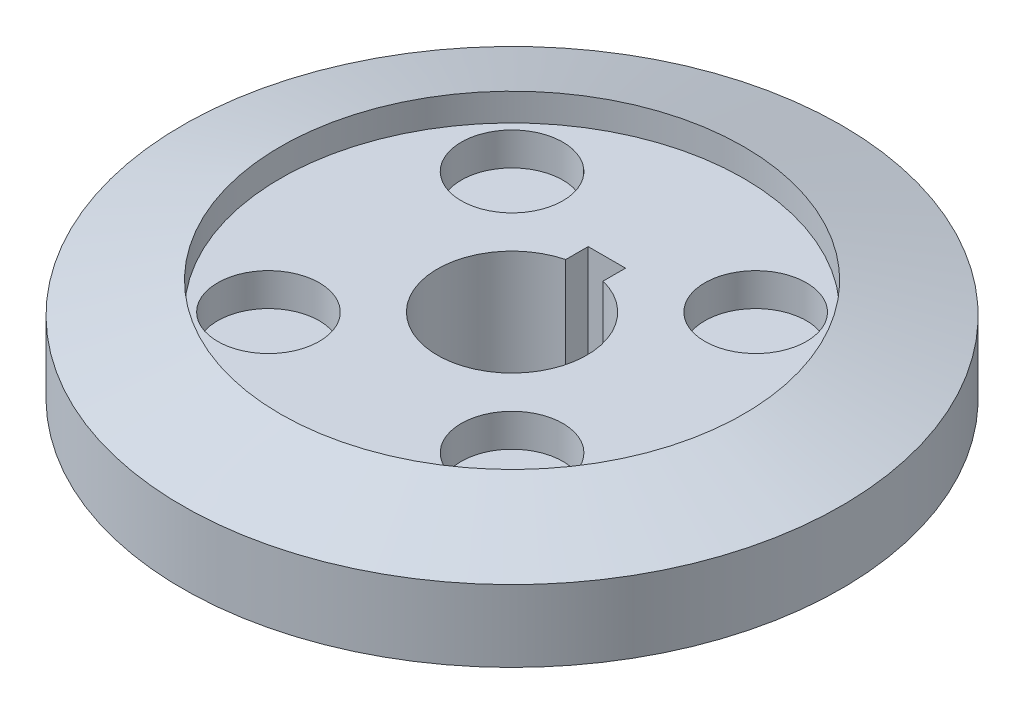
ISO-10303-21;
HEADER;
FILE_DESCRIPTION(('STEP AP214'),'2;1');
FILE_NAME('part.step','',(''),(''),'','','');
FILE_SCHEMA(('AUTOMOTIVE_DESIGN { 1 0 10303 214 1 1 1 1 }'));
ENDSEC;
DATA;
#1=APPLICATION_CONTEXT('core data for automotive mechanical design processes');
#2=APPLICATION_PROTOCOL_DEFINITION('international standard','automotive_design',2000,#1);
#3=PRODUCT_CONTEXT('',#1,'mechanical');
#4=PRODUCT('Part','Part','',(#3));
#5=PRODUCT_RELATED_PRODUCT_CATEGORY('part','',(#4));
#6=PRODUCT_DEFINITION_FORMATION('','',#4);
#7=PRODUCT_DEFINITION_CONTEXT('part definition',#1,'design');
#8=PRODUCT_DEFINITION('design','',#6,#7);
#9=PRODUCT_DEFINITION_SHAPE('','',#8);
#10=(LENGTH_UNIT() NAMED_UNIT(*) SI_UNIT(.MILLI.,.METRE.));
#11=(NAMED_UNIT(*) PLANE_ANGLE_UNIT() SI_UNIT($,.RADIAN.));
#12=(NAMED_UNIT(*) SI_UNIT($,.STERADIAN.) SOLID_ANGLE_UNIT());
#13=UNCERTAINTY_MEASURE_WITH_UNIT(LENGTH_MEASURE(1.E-05),#10,'distance_accuracy_value','');
#14=(GEOMETRIC_REPRESENTATION_CONTEXT(3) GLOBAL_UNCERTAINTY_ASSIGNED_CONTEXT((#13)) GLOBAL_UNIT_ASSIGNED_CONTEXT((#10,
#11,#12)) REPRESENTATION_CONTEXT('',''));
#15=CARTESIAN_POINT('',(0.,0.,0.));
#16=DIRECTION('',(0.,0.,1.));
#17=DIRECTION('',(1.,0.,0.));
#18=AXIS2_PLACEMENT_3D('',#15,#16,#17);
#19=CARTESIAN_POINT('',(0.,0.,0.));
#20=DIRECTION('',(0.,-1.,0.));
#21=DIRECTION('',(0.,0.,-1.));
#22=AXIS2_PLACEMENT_3D('',#19,#20,#21);
#23=CYLINDRICAL_SURFACE('',#22,10.05);
#24=CARTESIAN_POINT('',(0.,-1.5,0.));
#25=DIRECTION('',(0.,-1.,0.));
#26=DIRECTION('',(0.,0.,-1.));
#27=AXIS2_PLACEMENT_3D('',#24,#25,#26);
#28=CIRCLE('',#27,10.05);
#29=CARTESIAN_POINT('',(0.,-1.5,-10.05));
#30=VERTEX_POINT('',#29);
#31=EDGE_CURVE('E104',#30,#30,#28,.T.);
#32=ORIENTED_EDGE('',*,*,#31,.T.);
#33=EDGE_LOOP('',(#32));
#34=FACE_BOUND('',#33,.T.);
#35=CARTESIAN_POINT('',(0.,-6.,0.));
#36=DIRECTION('',(0.,-1.,0.));
#37=DIRECTION('',(0.,0.,-1.));
#38=AXIS2_PLACEMENT_3D('',#35,#36,#37);
#39=CIRCLE('',#38,10.05);
#40=CARTESIAN_POINT('',(0.,-6.,-10.05));
#41=VERTEX_POINT('',#40);
#42=EDGE_CURVE('E101',#41,#41,#39,.T.);
#43=ORIENTED_EDGE('',*,*,#42,.F.);
#44=EDGE_LOOP('',(#43));
#45=FACE_BOUND('',#44,.T.);
#46=ADVANCED_FACE('F39',(#34,#45),#23,.T.);
#47=CARTESIAN_POINT('',(5.,-6.,0.));
#48=DIRECTION('',(0.,-1.,0.));
#49=DIRECTION('',(0.,0.,-1.));
#50=AXIS2_PLACEMENT_3D('',#47,#48,#49);
#51=PLANE('',#50);
#52=DIRECTION('',(0.,0.,1.));
#53=VECTOR('',#52,1.);
#54=CARTESIAN_POINT('',(-1.25,-6.,-4.84122918275927));
#55=LINE('',#54,#53);
#56=CARTESIAN_POINT('',(-1.25,-6.,-6.34122918275927));
#57=VERTEX_POINT('',#56);
#58=CARTESIAN_POINT('',(-1.25,-6.,-4.84122918275927));
#59=VERTEX_POINT('',#58);
#60=EDGE_CURVE('E95',#57,#59,#55,.T.);
#61=ORIENTED_EDGE('',*,*,#60,.T.);
#62=CARTESIAN_POINT('',(0.,-6.,0.));
#63=DIRECTION('',(0.,-1.,0.));
#64=DIRECTION('',(0.,0.,-1.));
#65=AXIS2_PLACEMENT_3D('',#62,#63,#64);
#66=CIRCLE('',#65,5.);
#67=CARTESIAN_POINT('',(1.25,-6.,-4.84122918275927));
#68=VERTEX_POINT('',#67);
#69=EDGE_CURVE('E92',#68,#59,#66,.T.);
#70=ORIENTED_EDGE('',*,*,#69,.F.);
#71=DIRECTION('',(0.,0.,-1.));
#72=VECTOR('',#71,1.);
#73=CARTESIAN_POINT('',(1.25,-6.,-6.34122918275927));
#74=LINE('',#73,#72);
#75=CARTESIAN_POINT('',(1.25,-6.,-6.34122918275927));
#76=VERTEX_POINT('',#75);
#77=EDGE_CURVE('E77',#68,#76,#74,.T.);
#78=ORIENTED_EDGE('',*,*,#77,.T.);
#79=DIRECTION('',(-1.,0.,0.));
#80=VECTOR('',#79,1.);
#81=CARTESIAN_POINT('',(-1.25,-6.,-6.34122918275927));
#82=LINE('',#81,#80);
#83=EDGE_CURVE('E85',#76,#57,#82,.T.);
#84=ORIENTED_EDGE('',*,*,#83,.T.);
#85=EDGE_LOOP('',(#61,#70,#78,#84));
#86=FACE_BOUND('',#85,.T.);
#87=ORIENTED_EDGE('',*,*,#42,.T.);
#88=EDGE_LOOP('',(#87));
#89=FACE_BOUND('',#88,.T.);
#90=ADVANCED_FACE('F98',(#86,#89),#51,.T.);
#91=CARTESIAN_POINT('',(0.,0.,0.));
#92=DIRECTION('',(0.,-1.,0.));
#93=DIRECTION('',(0.,0.,-1.));
#94=AXIS2_PLACEMENT_3D('',#91,#92,#93);
#95=CYLINDRICAL_SURFACE('',#94,5.);
#96=DIRECTION('',(0.,1.,0.));
#97=VECTOR('',#96,1.);
#98=CARTESIAN_POINT('',(-1.25,-6.,-4.84122918275927));
#99=LINE('',#98,#97);
#100=CARTESIAN_POINT('',(-1.25,5.,-4.84122918275927));
#101=VERTEX_POINT('',#100);
#102=EDGE_CURVE('E122',#59,#101,#99,.T.);
#103=ORIENTED_EDGE('',*,*,#102,.T.);
#104=CARTESIAN_POINT('',(0.,5.,0.));
#105=DIRECTION('',(0.,-1.,0.));
#106=DIRECTION('',(0.,0.,-1.));
#107=AXIS2_PLACEMENT_3D('',#104,#105,#106);
#108=CIRCLE('',#107,5.);
#109=CARTESIAN_POINT('',(1.25,5.,-4.84122918275927));
#110=VERTEX_POINT('',#109);
#111=EDGE_CURVE('E94',#110,#101,#108,.T.);
#112=ORIENTED_EDGE('',*,*,#111,.F.);
#113=DIRECTION('',(0.,1.,0.));
#114=VECTOR('',#113,1.);
#115=CARTESIAN_POINT('',(1.25,-6.,-4.84122918275927));
#116=LINE('',#115,#114);
#117=EDGE_CURVE('E54',#68,#110,#116,.T.);
#118=ORIENTED_EDGE('',*,*,#117,.F.);
#119=ORIENTED_EDGE('',*,*,#69,.T.);
#120=EDGE_LOOP('',(#103,#112,#118,#119));
#121=FACE_BOUND('',#120,.T.);
#122=ADVANCED_FACE('F91',(#121),#95,.F.);
#123=CARTESIAN_POINT('',(15.5,5.,0.));
#124=DIRECTION('',(0.,1.,0.));
#125=DIRECTION('',(0.,0.,1.));
#126=AXIS2_PLACEMENT_3D('',#123,#124,#125);
#127=PLANE('',#126);
#128=CARTESIAN_POINT('',(8.14940565317495,5.,8.14940565317497));
#129=DIRECTION('',(0.,1.,0.));
#130=DIRECTION('',(-1.,0.,0.));
#131=AXIS2_PLACEMENT_3D('',#128,#129,#130);
#132=CIRCLE('',#131,3.4);
#133=CARTESIAN_POINT('',(4.74940565317494,5.,8.14940565317496));
#134=VERTEX_POINT('',#133);
#135=EDGE_CURVE('E165',#134,#134,#132,.T.);
#136=ORIENTED_EDGE('',*,*,#135,.F.);
#137=EDGE_LOOP('',(#136));
#138=FACE_BOUND('',#137,.T.);
#139=CARTESIAN_POINT('',(-8.14940565317495,5.,8.14940565317498));
#140=DIRECTION('',(0.,1.,0.));
#141=DIRECTION('',(0.,0.,-1.));
#142=AXIS2_PLACEMENT_3D('',#139,#140,#141);
#143=CIRCLE('',#142,3.4);
#144=CARTESIAN_POINT('',(-8.14940565317495,5.,4.74940565317497));
#145=VERTEX_POINT('',#144);
#146=EDGE_CURVE('E159',#145,#145,#143,.T.);
#147=ORIENTED_EDGE('',*,*,#146,.F.);
#148=EDGE_LOOP('',(#147));
#149=FACE_BOUND('',#148,.T.);
#150=CARTESIAN_POINT('',(-8.14940565317489,5.,-8.14940565317503));
#151=DIRECTION('',(0.,1.,0.));
#152=DIRECTION('',(1.,0.,0.));
#153=AXIS2_PLACEMENT_3D('',#150,#151,#152);
#154=CIRCLE('',#153,3.4);
#155=CARTESIAN_POINT('',(-4.74940565317489,5.,-8.14940565317499));
#156=VERTEX_POINT('',#155);
#157=EDGE_CURVE('E153',#156,#156,#154,.T.);
#158=ORIENTED_EDGE('',*,*,#157,.F.);
#159=EDGE_LOOP('',(#158));
#160=FACE_BOUND('',#159,.T.);
#161=CARTESIAN_POINT('',(8.14940565317495,5.,-8.14940565317498));
#162=DIRECTION('',(0.,1.,0.));
#163=DIRECTION('',(0.,0.,1.));
#164=AXIS2_PLACEMENT_3D('',#161,#162,#163);
#165=CIRCLE('',#164,3.4);
#166=CARTESIAN_POINT('',(8.14940565317495,5.,-4.74940565317497));
#167=VERTEX_POINT('',#166);
#168=EDGE_CURVE('E147',#167,#167,#165,.T.);
#169=ORIENTED_EDGE('',*,*,#168,.F.);
#170=EDGE_LOOP('',(#169));
#171=FACE_BOUND('',#170,.T.);
#172=DIRECTION('',(0.,0.,1.));
#173=VECTOR('',#172,1.);
#174=CARTESIAN_POINT('',(-1.25,5.,0.));
#175=LINE('',#174,#173);
#176=CARTESIAN_POINT('',(-1.25,5.,-6.34122918275927));
#177=VERTEX_POINT('',#176);
#178=EDGE_CURVE('E11',#177,#101,#175,.T.);
#179=ORIENTED_EDGE('',*,*,#178,.F.);
#180=DIRECTION('',(-1.,0.,0.));
#181=VECTOR('',#180,1.);
#182=CARTESIAN_POINT('',(15.5,5.,-6.34122918275927));
#183=LINE('',#182,#181);
#184=CARTESIAN_POINT('',(1.25,5.,-6.34122918275927));
#185=VERTEX_POINT('',#184);
#186=EDGE_CURVE('E47',#185,#177,#183,.T.);
#187=ORIENTED_EDGE('',*,*,#186,.F.);
#188=DIRECTION('',(0.,0.,-1.));
#189=VECTOR('',#188,1.);
#190=CARTESIAN_POINT('',(1.25,5.,0.));
#191=LINE('',#190,#189);
#192=EDGE_CURVE('E115',#110,#185,#191,.T.);
#193=ORIENTED_EDGE('',*,*,#192,.F.);
#194=ORIENTED_EDGE('',*,*,#111,.T.);
#195=EDGE_LOOP('',(#179,#187,#193,#194));
#196=FACE_BOUND('',#195,.T.);
#197=CARTESIAN_POINT('',(0.,5.,0.));
#198=DIRECTION('',(0.,-1.,0.));
#199=DIRECTION('',(0.,0.,-1.));
#200=AXIS2_PLACEMENT_3D('',#197,#198,#199);
#201=CIRCLE('',#200,15.5);
#202=CARTESIAN_POINT('',(0.,5.,-15.5));
#203=VERTEX_POINT('',#202);
#204=EDGE_CURVE('E106',#203,#203,#201,.T.);
#205=ORIENTED_EDGE('',*,*,#204,.F.);
#206=EDGE_LOOP('',(#205));
#207=FACE_BOUND('',#206,.T.);
#208=ADVANCED_FACE('F124',(#138,#149,#160,#171,#196,#207),#127,.T.);
#209=CARTESIAN_POINT('',(0.,0.,0.));
#210=DIRECTION('',(0.,-1.,0.));
#211=DIRECTION('',(0.,0.,-1.));
#212=AXIS2_PLACEMENT_3D('',#209,#210,#211);
#213=CYLINDRICAL_SURFACE('',#212,15.5);
#214=ORIENTED_EDGE('',*,*,#204,.T.);
#215=EDGE_LOOP('',(#214));
#216=FACE_BOUND('',#215,.T.);
#217=CARTESIAN_POINT('',(0.,6.84,0.));
#218=DIRECTION('',(0.,-1.,0.));
#219=DIRECTION('',(0.,0.,-1.));
#220=AXIS2_PLACEMENT_3D('',#217,#218,#219);
#221=CIRCLE('',#220,15.5);
#222=CARTESIAN_POINT('',(0.,6.84,-15.5));
#223=VERTEX_POINT('',#222);
#224=EDGE_CURVE('E133',#223,#223,#221,.T.);
#225=ORIENTED_EDGE('',*,*,#224,.F.);
#226=EDGE_LOOP('',(#225));
#227=FACE_BOUND('',#226,.T.);
#228=ADVANCED_FACE('F127',(#216,#227),#213,.F.);
#229=CARTESIAN_POINT('',(0.,4.8,0.));
#230=DIRECTION('',(0.,-1.,0.));
#231=DIRECTION('',(0.,0.,-1.));
#232=AXIS2_PLACEMENT_3D('',#229,#230,#231);
#233=CONICAL_SURFACE('',#232,22.05,1.26886797986734);
#234=ORIENTED_EDGE('',*,*,#224,.T.);
#235=EDGE_LOOP('',(#234));
#236=FACE_BOUND('',#235,.T.);
#237=CARTESIAN_POINT('',(0.,4.8,0.));
#238=DIRECTION('',(0.,-1.,0.));
#239=DIRECTION('',(0.,0.,-1.));
#240=AXIS2_PLACEMENT_3D('',#237,#238,#239);
#241=CIRCLE('',#240,22.05);
#242=CARTESIAN_POINT('',(0.,4.8,-22.05));
#243=VERTEX_POINT('',#242);
#244=EDGE_CURVE('E135',#243,#243,#241,.T.);
#245=ORIENTED_EDGE('',*,*,#244,.F.);
#246=EDGE_LOOP('',(#245));
#247=FACE_BOUND('',#246,.T.);
#248=ADVANCED_FACE('F212',(#236,#247),#233,.T.);
#249=CARTESIAN_POINT('',(0.,0.,0.));
#250=DIRECTION('',(0.,-1.,0.));
#251=DIRECTION('',(0.,0.,-1.));
#252=AXIS2_PLACEMENT_3D('',#249,#250,#251);
#253=CYLINDRICAL_SURFACE('',#252,22.05);
#254=ORIENTED_EDGE('',*,*,#244,.T.);
#255=EDGE_LOOP('',(#254));
#256=FACE_BOUND('',#255,.T.);
#257=CARTESIAN_POINT('',(0.,0.,0.));
#258=DIRECTION('',(0.,-1.,0.));
#259=DIRECTION('',(0.,0.,-1.));
#260=AXIS2_PLACEMENT_3D('',#257,#258,#259);
#261=CIRCLE('',#260,22.05);
#262=CARTESIAN_POINT('',(0.,0.,-22.05));
#263=VERTEX_POINT('',#262);
#264=EDGE_CURVE('E140',#263,#263,#261,.T.);
#265=ORIENTED_EDGE('',*,*,#264,.F.);
#266=EDGE_LOOP('',(#265));
#267=FACE_BOUND('',#266,.T.);
#268=ADVANCED_FACE('F215',(#256,#267),#253,.T.);
#269=CARTESIAN_POINT('',(10.05,0.,0.));
#270=DIRECTION('',(0.,-1.,0.));
#271=DIRECTION('',(0.,0.,-1.));
#272=AXIS2_PLACEMENT_3D('',#269,#270,#271);
#273=PLANE('',#272);
#274=CARTESIAN_POINT('',(0.,0.,0.));
#275=DIRECTION('',(0.,-1.,0.));
#276=DIRECTION('',(0.,0.,-1.));
#277=AXIS2_PLACEMENT_3D('',#274,#275,#276);
#278=CIRCLE('',#277,11.55);
#279=CARTESIAN_POINT('',(0.,0.,-11.55));
#280=VERTEX_POINT('',#279);
#281=EDGE_CURVE('E112',#280,#280,#278,.F.);
#282=ORIENTED_EDGE('',*,*,#281,.T.);
#283=EDGE_LOOP('',(#282));
#284=FACE_BOUND('',#283,.T.);
#285=ORIENTED_EDGE('',*,*,#264,.T.);
#286=EDGE_LOOP('',(#285));
#287=FACE_BOUND('',#286,.T.);
#288=ADVANCED_FACE('F219',(#284,#287),#273,.T.);
#289=CARTESIAN_POINT('',(0.,-1.5,0.));
#290=DIRECTION('',(0.,-1.,0.));
#291=DIRECTION('',(0.,0.,-1.));
#292=AXIS2_PLACEMENT_3D('',#289,#290,#291);
#293=TOROIDAL_SURFACE('',#292,11.55,1.5);
#294=ORIENTED_EDGE('',*,*,#281,.F.);
#295=EDGE_LOOP('',(#294));
#296=FACE_BOUND('',#295,.T.);
#297=ORIENTED_EDGE('',*,*,#31,.F.);
#298=EDGE_LOOP('',(#297));
#299=FACE_BOUND('',#298,.T.);
#300=ADVANCED_FACE('F41',(#296,#299),#293,.F.);
#301=CARTESIAN_POINT('',(-1.25,-6.,-4.84122918275927));
#302=DIRECTION('',(-1.,0.,0.));
#303=DIRECTION('',(0.,0.,1.));
#304=AXIS2_PLACEMENT_3D('',#301,#302,#303);
#305=PLANE('',#304);
#306=ORIENTED_EDGE('',*,*,#178,.T.);
#307=ORIENTED_EDGE('',*,*,#102,.F.);
#308=ORIENTED_EDGE('',*,*,#60,.F.);
#309=DIRECTION('',(0.,1.,0.));
#310=VECTOR('',#309,1.);
#311=CARTESIAN_POINT('',(-1.25,-6.,-6.34122918275927));
#312=LINE('',#311,#310);
#313=EDGE_CURVE('E119',#57,#177,#312,.T.);
#314=ORIENTED_EDGE('',*,*,#313,.T.);
#315=EDGE_LOOP('',(#306,#307,#308,#314));
#316=FACE_BOUND('',#315,.T.);
#317=ADVANCED_FACE('F121',(#316),#305,.F.);
#318=CARTESIAN_POINT('',(-1.25,-6.,-6.34122918275927));
#319=DIRECTION('',(0.,0.,-1.));
#320=DIRECTION('',(-1.,0.,0.));
#321=AXIS2_PLACEMENT_3D('',#318,#319,#320);
#322=PLANE('',#321);
#323=ORIENTED_EDGE('',*,*,#186,.T.);
#324=ORIENTED_EDGE('',*,*,#313,.F.);
#325=ORIENTED_EDGE('',*,*,#83,.F.);
#326=DIRECTION('',(0.,1.,0.));
#327=VECTOR('',#326,1.);
#328=CARTESIAN_POINT('',(1.25,-6.,-6.34122918275927));
#329=LINE('',#328,#327);
#330=EDGE_CURVE('E80',#76,#185,#329,.T.);
#331=ORIENTED_EDGE('',*,*,#330,.T.);
#332=EDGE_LOOP('',(#323,#324,#325,#331));
#333=FACE_BOUND('',#332,.T.);
#334=ADVANCED_FACE('F118',(#333),#322,.F.);
#335=CARTESIAN_POINT('',(1.25,-6.,-6.34122918275927));
#336=DIRECTION('',(1.,0.,0.));
#337=DIRECTION('',(0.,0.,-1.));
#338=AXIS2_PLACEMENT_3D('',#335,#336,#337);
#339=PLANE('',#338);
#340=ORIENTED_EDGE('',*,*,#192,.T.);
#341=ORIENTED_EDGE('',*,*,#330,.F.);
#342=ORIENTED_EDGE('',*,*,#77,.F.);
#343=ORIENTED_EDGE('',*,*,#117,.T.);
#344=EDGE_LOOP('',(#340,#341,#342,#343));
#345=FACE_BOUND('',#344,.T.);
#346=ADVANCED_FACE('F78',(#345),#339,.F.);
#347=CARTESIAN_POINT('',(8.14940565317495,2.8,-8.14940565317498));
#348=DIRECTION('',(0.,1.,0.));
#349=DIRECTION('',(0.,0.,1.));
#350=AXIS2_PLACEMENT_3D('',#347,#348,#349);
#351=CYLINDRICAL_SURFACE('',#350,3.4);
#352=CARTESIAN_POINT('',(8.14940565317495,2.8,-8.14940565317498));
#353=DIRECTION('',(0.,1.,0.));
#354=DIRECTION('',(0.,0.,1.));
#355=AXIS2_PLACEMENT_3D('',#352,#353,#354);
#356=CIRCLE('',#355,3.4);
#357=CARTESIAN_POINT('',(8.14940565317495,2.8,-4.74940565317497));
#358=VERTEX_POINT('',#357);
#359=EDGE_CURVE('E86',#358,#358,#356,.T.);
#360=ORIENTED_EDGE('',*,*,#359,.F.);
#361=EDGE_LOOP('',(#360));
#362=FACE_BOUND('',#361,.T.);
#363=ORIENTED_EDGE('',*,*,#168,.T.);
#364=EDGE_LOOP('',(#363));
#365=FACE_BOUND('',#364,.T.);
#366=ADVANCED_FACE('F186',(#362,#365),#351,.F.);
#367=CARTESIAN_POINT('',(8.14940565317495,2.8,-8.14940565317498));
#368=DIRECTION('',(0.,1.,0.));
#369=DIRECTION('',(0.,0.,1.));
#370=AXIS2_PLACEMENT_3D('',#367,#368,#369);
#371=PLANE('',#370);
#372=ORIENTED_EDGE('',*,*,#359,.T.);
#373=EDGE_LOOP('',(#372));
#374=FACE_BOUND('',#373,.T.);
#375=ADVANCED_FACE('F188',(#374),#371,.T.);
#376=CARTESIAN_POINT('',(-8.14940565317489,2.8,-8.14940565317503));
#377=DIRECTION('',(0.,1.,0.));
#378=DIRECTION('',(0.,0.,1.));
#379=AXIS2_PLACEMENT_3D('',#376,#377,#378);
#380=CYLINDRICAL_SURFACE('',#379,3.4);
#381=CARTESIAN_POINT('',(-8.14940565317489,2.8,-8.14940565317503));
#382=DIRECTION('',(0.,1.,0.));
#383=DIRECTION('',(1.,0.,0.));
#384=AXIS2_PLACEMENT_3D('',#381,#382,#383);
#385=CIRCLE('',#384,3.4);
#386=CARTESIAN_POINT('',(-4.74940565317489,2.8,-8.14940565317499));
#387=VERTEX_POINT('',#386);
#388=EDGE_CURVE('E156',#387,#387,#385,.T.);
#389=ORIENTED_EDGE('',*,*,#388,.F.);
#390=EDGE_LOOP('',(#389));
#391=FACE_BOUND('',#390,.T.);
#392=ORIENTED_EDGE('',*,*,#157,.T.);
#393=EDGE_LOOP('',(#392));
#394=FACE_BOUND('',#393,.T.);
#395=ADVANCED_FACE('F195',(#391,#394),#380,.F.);
#396=CARTESIAN_POINT('',(-8.14940565317489,2.8,-8.14940565317503));
#397=DIRECTION('',(0.,1.,0.));
#398=DIRECTION('',(1.,0.,0.));
#399=AXIS2_PLACEMENT_3D('',#396,#397,#398);
#400=PLANE('',#399);
#401=ORIENTED_EDGE('',*,*,#388,.T.);
#402=EDGE_LOOP('',(#401));
#403=FACE_BOUND('',#402,.T.);
#404=ADVANCED_FACE('F326',(#403),#400,.T.);
#405=CARTESIAN_POINT('',(-8.14940565317495,2.8,8.14940565317498));
#406=DIRECTION('',(0.,1.,0.));
#407=DIRECTION('',(0.,0.,1.));
#408=AXIS2_PLACEMENT_3D('',#405,#406,#407);
#409=CYLINDRICAL_SURFACE('',#408,3.4);
#410=CARTESIAN_POINT('',(-8.14940565317495,2.8,8.14940565317498));
#411=DIRECTION('',(0.,1.,0.));
#412=DIRECTION('',(0.,0.,-1.));
#413=AXIS2_PLACEMENT_3D('',#410,#411,#412);
#414=CIRCLE('',#413,3.4);
#415=CARTESIAN_POINT('',(-8.14940565317495,2.8,4.74940565317497));
#416=VERTEX_POINT('',#415);
#417=EDGE_CURVE('E162',#416,#416,#414,.T.);
#418=ORIENTED_EDGE('',*,*,#417,.F.);
#419=EDGE_LOOP('',(#418));
#420=FACE_BOUND('',#419,.T.);
#421=ORIENTED_EDGE('',*,*,#146,.T.);
#422=EDGE_LOOP('',(#421));
#423=FACE_BOUND('',#422,.T.);
#424=ADVANCED_FACE('F335',(#420,#423),#409,.F.);
#425=CARTESIAN_POINT('',(-8.14940565317495,2.8,8.14940565317498));
#426=DIRECTION('',(0.,1.,0.));
#427=DIRECTION('',(0.,0.,-1.));
#428=AXIS2_PLACEMENT_3D('',#425,#426,#427);
#429=PLANE('',#428);
#430=ORIENTED_EDGE('',*,*,#417,.T.);
#431=EDGE_LOOP('',(#430));
#432=FACE_BOUND('',#431,.T.);
#433=ADVANCED_FACE('F176',(#432),#429,.T.);
#434=CARTESIAN_POINT('',(8.14940565317495,2.8,8.14940565317497));
#435=DIRECTION('',(0.,1.,0.));
#436=DIRECTION('',(0.,0.,1.));
#437=AXIS2_PLACEMENT_3D('',#434,#435,#436);
#438=CYLINDRICAL_SURFACE('',#437,3.4);
#439=CARTESIAN_POINT('',(8.14940565317495,2.8,8.14940565317497));
#440=DIRECTION('',(0.,1.,0.));
#441=DIRECTION('',(-1.,0.,0.));
#442=AXIS2_PLACEMENT_3D('',#439,#440,#441);
#443=CIRCLE('',#442,3.4);
#444=CARTESIAN_POINT('',(4.74940565317494,2.8,8.14940565317496));
#445=VERTEX_POINT('',#444);
#446=EDGE_CURVE('E150',#445,#445,#443,.T.);
#447=ORIENTED_EDGE('',*,*,#446,.F.);
#448=EDGE_LOOP('',(#447));
#449=FACE_BOUND('',#448,.T.);
#450=ORIENTED_EDGE('',*,*,#135,.T.);
#451=EDGE_LOOP('',(#450));
#452=FACE_BOUND('',#451,.T.);
#453=ADVANCED_FACE('F173',(#449,#452),#438,.F.);
#454=CARTESIAN_POINT('',(8.14940565317495,2.8,8.14940565317497));
#455=DIRECTION('',(0.,1.,0.));
#456=DIRECTION('',(-1.,0.,0.));
#457=AXIS2_PLACEMENT_3D('',#454,#455,#456);
#458=PLANE('',#457);
#459=ORIENTED_EDGE('',*,*,#446,.T.);
#460=EDGE_LOOP('',(#459));
#461=FACE_BOUND('',#460,.T.);
#462=ADVANCED_FACE('F171',(#461),#458,.T.);
#463=CLOSED_SHELL('',(#46,#90,#122,#208,#228,#248,#268,#288,#300,#317,#334,#346,#366,#375,#395,
#404,#424,#433,#453,#462));
#464=MANIFOLD_SOLID_BREP('B2',#463);
#465=ADVANCED_BREP_SHAPE_REPRESENTATION('',(#18,#464),#14);
#466=SHAPE_DEFINITION_REPRESENTATION(#9,#465);
ENDSEC;
END-ISO-10303-21;
